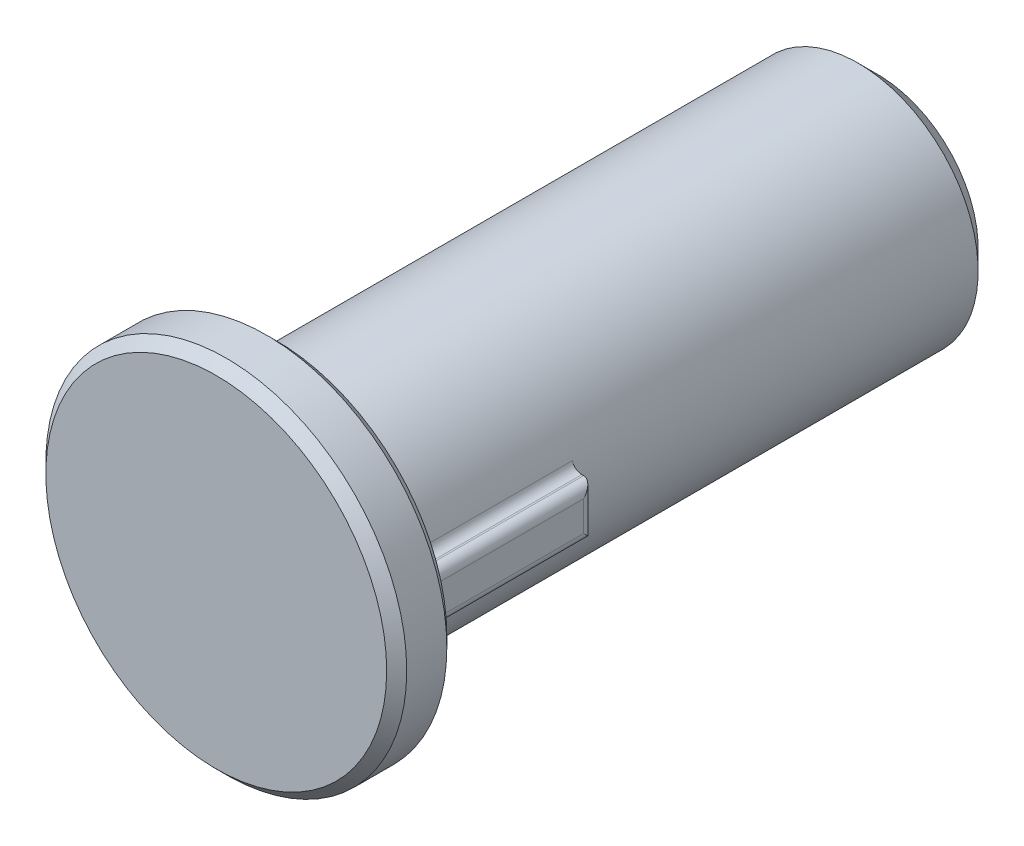
ISO-10303-21;
HEADER;
FILE_DESCRIPTION(('STEP AP214'),'2;1');
FILE_NAME('part.step','',(''),(''),'','','');
FILE_SCHEMA(('AUTOMOTIVE_DESIGN { 1 0 10303 214 1 1 1 1 }'));
ENDSEC;
DATA;
#1=APPLICATION_CONTEXT('core data for automotive mechanical design processes');
#2=APPLICATION_PROTOCOL_DEFINITION('international standard','automotive_design',2000,#1);
#3=PRODUCT_CONTEXT('',#1,'mechanical');
#4=PRODUCT('Part','Part','',(#3));
#5=PRODUCT_RELATED_PRODUCT_CATEGORY('part','',(#4));
#6=PRODUCT_DEFINITION_FORMATION('','',#4);
#7=PRODUCT_DEFINITION_CONTEXT('part definition',#1,'design');
#8=PRODUCT_DEFINITION('design','',#6,#7);
#9=PRODUCT_DEFINITION_SHAPE('','',#8);
#10=(LENGTH_UNIT() NAMED_UNIT(*) SI_UNIT(.MILLI.,.METRE.));
#11=(NAMED_UNIT(*) PLANE_ANGLE_UNIT() SI_UNIT($,.RADIAN.));
#12=(NAMED_UNIT(*) SI_UNIT($,.STERADIAN.) SOLID_ANGLE_UNIT());
#13=UNCERTAINTY_MEASURE_WITH_UNIT(LENGTH_MEASURE(1.E-05),#10,'distance_accuracy_value','');
#14=(GEOMETRIC_REPRESENTATION_CONTEXT(3) GLOBAL_UNCERTAINTY_ASSIGNED_CONTEXT((#13)) GLOBAL_UNIT_ASSIGNED_CONTEXT((#10,
#11,#12)) REPRESENTATION_CONTEXT('',''));
#15=CARTESIAN_POINT('',(0.,0.,0.));
#16=DIRECTION('',(0.,0.,1.));
#17=DIRECTION('',(1.,0.,0.));
#18=AXIS2_PLACEMENT_3D('',#15,#16,#17);
#19=CARTESIAN_POINT('',(0.,0.,0.));
#20=DIRECTION('',(0.,0.,1.));
#21=DIRECTION('',(1.,0.,0.));
#22=AXIS2_PLACEMENT_3D('',#19,#20,#21);
#23=PLANE('',#22);
#24=CARTESIAN_POINT('',(6.32420801106751,-0.66282664863295,0.));
#25=DIRECTION('',(0.,0.,1.));
#26=DIRECTION('',(1.,0.,0.));
#27=AXIS2_PLACEMENT_3D('',#24,#25,#26);
#28=CIRCLE('',#27,1.);
#29=CARTESIAN_POINT('',(6.32420801106751,-1.66282664863295,0.));
#30=VERTEX_POINT('',#29);
#31=CARTESIAN_POINT('',(7.32420801106751,-0.66282664863295,0.));
#32=VERTEX_POINT('',#31);
#33=EDGE_CURVE('E259',#30,#32,#28,.T.);
#34=ORIENTED_EDGE('',*,*,#33,.T.);
#35=DIRECTION('',(0.,1.,0.));
#36=VECTOR('',#35,1.);
#37=CARTESIAN_POINT('',(7.32420801106751,0.83717335136705,0.));
#38=LINE('',#37,#36);
#39=CARTESIAN_POINT('',(7.32420801106751,0.83717335136705,0.));
#40=VERTEX_POINT('',#39);
#41=EDGE_CURVE('E262',#32,#40,#38,.T.);
#42=ORIENTED_EDGE('',*,*,#41,.T.);
#43=CARTESIAN_POINT('',(6.32420801106751,0.83717335136705,0.));
#44=DIRECTION('',(0.,0.,1.));
#45=DIRECTION('',(1.,0.,0.));
#46=AXIS2_PLACEMENT_3D('',#43,#44,#45);
#47=CIRCLE('',#46,1.);
#48=CARTESIAN_POINT('',(6.32420801106751,1.83717335136705,0.));
#49=VERTEX_POINT('',#48);
#50=EDGE_CURVE('E256',#40,#49,#47,.T.);
#51=ORIENTED_EDGE('',*,*,#50,.T.);
#52=DIRECTION('',(-1.,0.,0.));
#53=VECTOR('',#52,1.);
#54=CARTESIAN_POINT('',(6.23496544313012,1.83717335136705,0.));
#55=LINE('',#54,#53);
#56=CARTESIAN_POINT('',(6.23496544313012,1.83717335136705,0.));
#57=VERTEX_POINT('',#56);
#58=EDGE_CURVE('E250',#49,#57,#55,.T.);
#59=ORIENTED_EDGE('',*,*,#58,.T.);
#60=CARTESIAN_POINT('',(0.,0.,0.));
#61=DIRECTION('',(0.,0.,1.));
#62=DIRECTION('',(1.,0.,0.));
#63=AXIS2_PLACEMENT_3D('',#60,#61,#62);
#64=CIRCLE('',#63,6.5);
#65=CARTESIAN_POINT('',(6.28370969544235,-1.66282664863295,0.));
#66=VERTEX_POINT('',#65);
#67=EDGE_CURVE('E247',#57,#66,#64,.T.);
#68=ORIENTED_EDGE('',*,*,#67,.T.);
#69=DIRECTION('',(1.,0.,0.));
#70=VECTOR('',#69,1.);
#71=CARTESIAN_POINT('',(6.32420801106751,-1.66282664863295,0.));
#72=LINE('',#71,#70);
#73=EDGE_CURVE('E253',#66,#30,#72,.T.);
#74=ORIENTED_EDGE('',*,*,#73,.T.);
#75=EDGE_LOOP('',(#34,#42,#51,#59,#68,#74));
#76=FACE_BOUND('',#75,.T.);
#77=CARTESIAN_POINT('',(0.,0.,0.));
#78=DIRECTION('',(0.,0.,1.));
#79=DIRECTION('',(1.,0.,0.));
#80=AXIS2_PLACEMENT_3D('',#77,#78,#79);
#81=CIRCLE('',#80,8.5);
#82=CARTESIAN_POINT('',(8.5,0.,0.));
#83=VERTEX_POINT('',#82);
#84=EDGE_CURVE('E243',#83,#83,#81,.F.);
#85=ORIENTED_EDGE('',*,*,#84,.T.);
#86=EDGE_LOOP('',(#85));
#87=FACE_BOUND('',#86,.T.);
#88=ADVANCED_FACE('F43',(#76,#87),#23,.F.);
#89=CARTESIAN_POINT('',(0.,0.,-30.));
#90=DIRECTION('',(0.,0.,1.));
#91=DIRECTION('',(1.,0.,0.));
#92=AXIS2_PLACEMENT_3D('',#89,#90,#91);
#93=CYLINDRICAL_SURFACE('',#92,6.);
#94=CARTESIAN_POINT('',(0.,0.,-29.));
#95=DIRECTION('',(0.,0.,-1.));
#96=DIRECTION('',(-1.,0.,0.));
#97=AXIS2_PLACEMENT_3D('',#94,#95,#96);
#98=CIRCLE('',#97,6.);
#99=CARTESIAN_POINT('',(-6.,0.,-29.));
#100=VERTEX_POINT('',#99);
#101=EDGE_CURVE('E331',#100,#100,#98,.F.);
#102=ORIENTED_EDGE('',*,*,#101,.T.);
#103=EDGE_LOOP('',(#102));
#104=FACE_BOUND('',#103,.T.);
#105=DIRECTION('',(0.,0.,1.));
#106=VECTOR('',#105,1.);
#107=CARTESIAN_POINT('',(5.80034741117755,-1.53491690643042,-30.));
#108=LINE('',#107,#106);
#109=CARTESIAN_POINT('',(5.80034741117755,-1.53491690643042,-9.));
#110=VERTEX_POINT('',#109);
#111=CARTESIAN_POINT('',(5.80034741117755,-1.53491690643042,-0.500000000000007));
#112=VERTEX_POINT('',#111);
#113=EDGE_CURVE('E200',#110,#112,#108,.T.);
#114=ORIENTED_EDGE('',*,*,#113,.T.);
#115=CARTESIAN_POINT('',(0.,0.,-0.500000000000007));
#116=DIRECTION('',(0.,0.,1.));
#117=DIRECTION('',(1.,0.,0.));
#118=AXIS2_PLACEMENT_3D('',#115,#116,#117);
#119=CIRCLE('',#118,6.);
#120=CARTESIAN_POINT('',(5.7553527167355,1.69585232433882,-0.500000000000007));
#121=VERTEX_POINT('',#120);
#122=EDGE_CURVE('E284',#112,#121,#119,.F.);
#123=ORIENTED_EDGE('',*,*,#122,.T.);
#124=DIRECTION('',(0.,0.,1.));
#125=VECTOR('',#124,1.);
#126=CARTESIAN_POINT('',(5.7553527167355,1.69585232433882,-30.));
#127=LINE('',#126,#125);
#128=CARTESIAN_POINT('',(5.7553527167355,1.69585232433882,-9.));
#129=VERTEX_POINT('',#128);
#130=EDGE_CURVE('E197',#121,#129,#127,.F.);
#131=ORIENTED_EDGE('',*,*,#130,.T.);
#132=CARTESIAN_POINT('',(0.,0.,-9.));
#133=DIRECTION('',(0.,0.,1.));
#134=DIRECTION('',(1.,0.,0.));
#135=AXIS2_PLACEMENT_3D('',#132,#133,#134);
#136=CIRCLE('',#135,6.);
#137=EDGE_CURVE('E186',#110,#129,#136,.T.);
#138=ORIENTED_EDGE('',*,*,#137,.F.);
#139=EDGE_LOOP('',(#114,#123,#131,#138));
#140=FACE_BOUND('',#139,.T.);
#141=ADVANCED_FACE('F456',(#104,#140),#93,.T.);
#142=CARTESIAN_POINT('',(0.,0.,3.));
#143=DIRECTION('',(0.,0.,-1.));
#144=DIRECTION('',(-1.,0.,0.));
#145=AXIS2_PLACEMENT_3D('',#142,#143,#144);
#146=CYLINDRICAL_SURFACE('',#145,9.);
#147=CARTESIAN_POINT('',(0.,0.,0.500000000000002));
#148=DIRECTION('',(0.,0.,1.));
#149=DIRECTION('',(1.,0.,0.));
#150=AXIS2_PLACEMENT_3D('',#147,#148,#149);
#151=CIRCLE('',#150,9.);
#152=CARTESIAN_POINT('',(9.,0.,0.500000000000002));
#153=VERTEX_POINT('',#152);
#154=EDGE_CURVE('E291',#153,#153,#151,.T.);
#155=ORIENTED_EDGE('',*,*,#154,.T.);
#156=EDGE_LOOP('',(#155));
#157=FACE_BOUND('',#156,.T.);
#158=CARTESIAN_POINT('',(0.,0.,2.5));
#159=DIRECTION('',(0.,0.,1.));
#160=DIRECTION('',(1.,0.,0.));
#161=AXIS2_PLACEMENT_3D('',#158,#159,#160);
#162=CIRCLE('',#161,9.);
#163=CARTESIAN_POINT('',(9.,0.,2.5));
#164=VERTEX_POINT('',#163);
#165=EDGE_CURVE('E287',#164,#164,#162,.F.);
#166=ORIENTED_EDGE('',*,*,#165,.T.);
#167=EDGE_LOOP('',(#166));
#168=FACE_BOUND('',#167,.T.);
#169=ADVANCED_FACE('F452',(#157,#168),#146,.T.);
#170=CARTESIAN_POINT('',(0.,0.,3.));
#171=DIRECTION('',(0.,0.,1.));
#172=DIRECTION('',(1.,0.,0.));
#173=AXIS2_PLACEMENT_3D('',#170,#171,#172);
#174=PLANE('',#173);
#175=CARTESIAN_POINT('',(0.,0.,3.));
#176=DIRECTION('',(0.,0.,1.));
#177=DIRECTION('',(1.,0.,0.));
#178=AXIS2_PLACEMENT_3D('',#175,#176,#177);
#179=CIRCLE('',#178,8.5);
#180=CARTESIAN_POINT('',(8.5,0.,3.));
#181=VERTEX_POINT('',#180);
#182=EDGE_CURVE('E295',#181,#181,#179,.T.);
#183=ORIENTED_EDGE('',*,*,#182,.T.);
#184=EDGE_LOOP('',(#183));
#185=FACE_BOUND('',#184,.T.);
#186=ADVANCED_FACE('F455',(#185),#174,.T.);
#187=CARTESIAN_POINT('',(0.,0.,-30.));
#188=DIRECTION('',(0.,0.,-1.));
#189=DIRECTION('',(-1.,0.,0.));
#190=AXIS2_PLACEMENT_3D('',#187,#188,#189);
#191=PLANE('',#190);
#192=DIRECTION('',(0.989422993866325,-0.145059088679747,0.));
#193=VECTOR('',#192,1.);
#194=CARTESIAN_POINT('',(1.84976935108709,-2.7979194677079,-30.));
#195=LINE('',#194,#193);
#196=CARTESIAN_POINT('',(-2.78622919644876,-2.1182367348473,-30.));
#197=VERTEX_POINT('',#196);
#198=CARTESIAN_POINT('',(2.06093375305002,-2.82887823448433,-30.));
#199=VERTEX_POINT('',#198);
#200=EDGE_CURVE('E66',#197,#199,#195,.T.);
#201=ORIENTED_EDGE('',*,*,#200,.T.);
#202=CARTESIAN_POINT('',(0.,0.,-30.));
#203=DIRECTION('',(0.,0.,-1.));
#204=DIRECTION('',(-1.,0.,0.));
#205=AXIS2_PLACEMENT_3D('',#202,#203,#204);
#206=CIRCLE('',#205,3.5);
#207=EDGE_CURVE('E59',#199,#197,#206,.F.);
#208=ORIENTED_EDGE('',*,*,#207,.T.);
#209=EDGE_LOOP('',(#201,#208));
#210=FACE_BOUND('',#209,.T.);
#211=CARTESIAN_POINT('',(0.,0.,-30.));
#212=DIRECTION('',(0.,0.,-1.));
#213=DIRECTION('',(-1.,0.,0.));
#214=AXIS2_PLACEMENT_3D('',#211,#212,#213);
#215=CIRCLE('',#214,5.);
#216=CARTESIAN_POINT('',(-5.,0.,-30.));
#217=VERTEX_POINT('',#216);
#218=EDGE_CURVE('E299',#217,#217,#215,.T.);
#219=ORIENTED_EDGE('',*,*,#218,.T.);
#220=EDGE_LOOP('',(#219));
#221=FACE_BOUND('',#220,.T.);
#222=ADVANCED_FACE('F463',(#210,#221),#191,.T.);
#223=CARTESIAN_POINT('',(5.17452538988969,-1.16282664863295,-9.));
#224=DIRECTION('',(0.,1.,0.));
#225=DIRECTION('',(-1.,0.,0.));
#226=AXIS2_PLACEMENT_3D('',#223,#224,#225);
#227=PLANE('',#226);
#228=DIRECTION('',(0.,0.,1.));
#229=VECTOR('',#228,1.);
#230=CARTESIAN_POINT('',(6.32420801106751,-1.16282664863295,-9.));
#231=LINE('',#230,#229);
#232=CARTESIAN_POINT('',(6.32420801106751,-1.16282664863295,-9.));
#233=VERTEX_POINT('',#232);
#234=CARTESIAN_POINT('',(6.32420801106751,-1.16282664863295,-0.500000000000006));
#235=VERTEX_POINT('',#234);
#236=EDGE_CURVE('E190',#233,#235,#231,.T.);
#237=ORIENTED_EDGE('',*,*,#236,.T.);
#238=DIRECTION('',(-1.,0.,0.));
#239=VECTOR('',#238,1.);
#240=CARTESIAN_POINT('',(6.28370969544234,-1.16282664863295,-0.500000000000006));
#241=LINE('',#240,#239);
#242=CARTESIAN_POINT('',(6.28370969544234,-1.16282664863295,-0.500000000000007));
#243=VERTEX_POINT('',#242);
#244=EDGE_CURVE('E272',#235,#243,#241,.T.);
#245=ORIENTED_EDGE('',*,*,#244,.T.);
#246=DIRECTION('',(0.,0.,-1.));
#247=VECTOR('',#246,1.);
#248=CARTESIAN_POINT('',(6.28370969544234,-1.16282664863295,-9.));
#249=LINE('',#248,#247);
#250=CARTESIAN_POINT('',(6.28370969544234,-1.16282664863295,-9.));
#251=VERTEX_POINT('',#250);
#252=EDGE_CURVE('E194',#243,#251,#249,.T.);
#253=ORIENTED_EDGE('',*,*,#252,.T.);
#254=DIRECTION('',(-1.,0.,0.));
#255=VECTOR('',#254,1.);
#256=CARTESIAN_POINT('',(5.17452538988969,-1.16282664863295,-9.));
#257=LINE('',#256,#255);
#258=EDGE_CURVE('E177',#233,#251,#257,.T.);
#259=ORIENTED_EDGE('',*,*,#258,.F.);
#260=EDGE_LOOP('',(#237,#245,#253,#259));
#261=FACE_BOUND('',#260,.T.);
#262=ADVANCED_FACE('F470',(#261),#227,.F.);
#263=CARTESIAN_POINT('',(5.17452538988969,1.33717335136705,-9.));
#264=DIRECTION('',(0.,-1.,0.));
#265=DIRECTION('',(1.,0.,0.));
#266=AXIS2_PLACEMENT_3D('',#263,#264,#265);
#267=PLANE('',#266);
#268=DIRECTION('',(0.,0.,-1.));
#269=VECTOR('',#268,1.);
#270=CARTESIAN_POINT('',(6.23496544313012,1.33717335136705,0.));
#271=LINE('',#270,#269);
#272=CARTESIAN_POINT('',(6.23496544313012,1.33717335136705,-9.));
#273=VERTEX_POINT('',#272);
#274=CARTESIAN_POINT('',(6.23496544313012,1.33717335136705,-0.500000000000007));
#275=VERTEX_POINT('',#274);
#276=EDGE_CURVE('E207',#273,#275,#271,.F.);
#277=ORIENTED_EDGE('',*,*,#276,.T.);
#278=DIRECTION('',(1.,0.,0.));
#279=VECTOR('',#278,1.);
#280=CARTESIAN_POINT('',(6.32420801106751,1.33717335136705,-0.500000000000006));
#281=LINE('',#280,#279);
#282=CARTESIAN_POINT('',(6.32420801106751,1.33717335136705,-0.500000000000006));
#283=VERTEX_POINT('',#282);
#284=EDGE_CURVE('E275',#275,#283,#281,.T.);
#285=ORIENTED_EDGE('',*,*,#284,.T.);
#286=DIRECTION('',(0.,0.,1.));
#287=VECTOR('',#286,1.);
#288=CARTESIAN_POINT('',(6.32420801106751,1.33717335136705,-9.));
#289=LINE('',#288,#287);
#290=CARTESIAN_POINT('',(6.32420801106751,1.33717335136705,-9.));
#291=VERTEX_POINT('',#290);
#292=EDGE_CURVE('E204',#283,#291,#289,.F.);
#293=ORIENTED_EDGE('',*,*,#292,.T.);
#294=DIRECTION('',(1.,0.,0.));
#295=VECTOR('',#294,1.);
#296=CARTESIAN_POINT('',(5.17452538988969,1.33717335136705,-9.));
#297=LINE('',#296,#295);
#298=EDGE_CURVE('E181',#273,#291,#297,.T.);
#299=ORIENTED_EDGE('',*,*,#298,.F.);
#300=EDGE_LOOP('',(#277,#285,#293,#299));
#301=FACE_BOUND('',#300,.T.);
#302=ADVANCED_FACE('F474',(#301),#267,.F.);
#303=CARTESIAN_POINT('',(6.82420801106751,1.33717335136705,-9.));
#304=DIRECTION('',(-1.,0.,0.));
#305=DIRECTION('',(0.,0.,1.));
#306=AXIS2_PLACEMENT_3D('',#303,#304,#305);
#307=PLANE('',#306);
#308=DIRECTION('',(0.,0.,1.));
#309=VECTOR('',#308,1.);
#310=CARTESIAN_POINT('',(6.82420801106751,0.83717335136705,-9.));
#311=LINE('',#310,#309);
#312=CARTESIAN_POINT('',(6.82420801106751,0.83717335136705,-8.5));
#313=VERTEX_POINT('',#312);
#314=CARTESIAN_POINT('',(6.82420801106751,0.83717335136705,-0.500000000000006));
#315=VERTEX_POINT('',#314);
#316=EDGE_CURVE('E215',#313,#315,#311,.T.);
#317=ORIENTED_EDGE('',*,*,#316,.T.);
#318=DIRECTION('',(0.,-1.,0.));
#319=VECTOR('',#318,1.);
#320=CARTESIAN_POINT('',(6.82420801106751,-0.66282664863295,-0.500000000000006));
#321=LINE('',#320,#319);
#322=CARTESIAN_POINT('',(6.82420801106751,-0.66282664863295,-0.500000000000006));
#323=VERTEX_POINT('',#322);
#324=EDGE_CURVE('E232',#315,#323,#321,.T.);
#325=ORIENTED_EDGE('',*,*,#324,.T.);
#326=DIRECTION('',(0.,0.,1.));
#327=VECTOR('',#326,1.);
#328=CARTESIAN_POINT('',(6.82420801106751,-0.66282664863295,-9.));
#329=LINE('',#328,#327);
#330=CARTESIAN_POINT('',(6.82420801106751,-0.66282664863295,-8.5));
#331=VERTEX_POINT('',#330);
#332=EDGE_CURVE('E222',#323,#331,#329,.F.);
#333=ORIENTED_EDGE('',*,*,#332,.T.);
#334=DIRECTION('',(0.,-1.,0.));
#335=VECTOR('',#334,1.);
#336=CARTESIAN_POINT('',(6.82420801106751,1.33717335136705,-8.5));
#337=LINE('',#336,#335);
#338=EDGE_CURVE('E219',#331,#313,#337,.F.);
#339=ORIENTED_EDGE('',*,*,#338,.T.);
#340=EDGE_LOOP('',(#317,#325,#333,#339));
#341=FACE_BOUND('',#340,.T.);
#342=ADVANCED_FACE('F471',(#341),#307,.F.);
#343=CARTESIAN_POINT('',(0.,0.,-9.));
#344=DIRECTION('',(0.,0.,1.));
#345=DIRECTION('',(1.,0.,0.));
#346=AXIS2_PLACEMENT_3D('',#343,#344,#345);
#347=PLANE('',#346);
#348=ORIENTED_EDGE('',*,*,#298,.T.);
#349=DIRECTION('',(0.,-1.,0.));
#350=VECTOR('',#349,1.);
#351=CARTESIAN_POINT('',(6.32420801106751,0.,-9.));
#352=LINE('',#351,#350);
#353=EDGE_CURVE('E211',#291,#233,#352,.T.);
#354=ORIENTED_EDGE('',*,*,#353,.T.);
#355=ORIENTED_EDGE('',*,*,#258,.T.);
#356=CARTESIAN_POINT('',(6.28370969544234,-1.66282664863295,-9.));
#357=DIRECTION('',(0.,0.,1.));
#358=DIRECTION('',(1.,0.,0.));
#359=AXIS2_PLACEMENT_3D('',#356,#357,#358);
#360=CIRCLE('',#359,0.5);
#361=EDGE_CURVE('E225',#251,#110,#360,.T.);
#362=ORIENTED_EDGE('',*,*,#361,.T.);
#363=ORIENTED_EDGE('',*,*,#137,.T.);
#364=CARTESIAN_POINT('',(6.23496544313012,1.83717335136705,-9.));
#365=DIRECTION('',(0.,0.,1.));
#366=DIRECTION('',(1.,0.,0.));
#367=AXIS2_PLACEMENT_3D('',#364,#365,#366);
#368=CIRCLE('',#367,0.5);
#369=EDGE_CURVE('E229',#129,#273,#368,.T.);
#370=ORIENTED_EDGE('',*,*,#369,.T.);
#371=EDGE_LOOP('',(#348,#354,#355,#362,#363,#370));
#372=FACE_BOUND('',#371,.T.);
#373=ADVANCED_FACE('F450',(#372),#347,.F.);
#374=CARTESIAN_POINT('',(6.28370969544234,-1.66282664863295,-30.));
#375=DIRECTION('',(0.,0.,1.));
#376=DIRECTION('',(1.,0.,0.));
#377=AXIS2_PLACEMENT_3D('',#374,#375,#376);
#378=CYLINDRICAL_SURFACE('',#377,0.5);
#379=ORIENTED_EDGE('',*,*,#252,.F.);
#380=CARTESIAN_POINT('',(6.28370969544234,-1.66282664863295,-0.500000000000007));
#381=DIRECTION('',(0.,0.,1.));
#382=DIRECTION('',(1.,0.,0.));
#383=AXIS2_PLACEMENT_3D('',#380,#381,#382);
#384=CIRCLE('',#383,0.5);
#385=EDGE_CURVE('E278',#243,#112,#384,.T.);
#386=ORIENTED_EDGE('',*,*,#385,.T.);
#387=ORIENTED_EDGE('',*,*,#113,.F.);
#388=ORIENTED_EDGE('',*,*,#361,.F.);
#389=EDGE_LOOP('',(#379,#386,#387,#388));
#390=FACE_BOUND('',#389,.T.);
#391=ADVANCED_FACE('F446',(#390),#378,.F.);
#392=CARTESIAN_POINT('',(6.23496544313012,1.83717335136705,-30.));
#393=DIRECTION('',(0.,0.,1.));
#394=DIRECTION('',(1.,0.,0.));
#395=AXIS2_PLACEMENT_3D('',#392,#393,#394);
#396=CYLINDRICAL_SURFACE('',#395,0.5);
#397=ORIENTED_EDGE('',*,*,#130,.F.);
#398=CARTESIAN_POINT('',(6.23496544313012,1.83717335136705,-0.500000000000007));
#399=DIRECTION('',(0.,0.,1.));
#400=DIRECTION('',(1.,0.,0.));
#401=AXIS2_PLACEMENT_3D('',#398,#399,#400);
#402=CIRCLE('',#401,0.5);
#403=EDGE_CURVE('E281',#121,#275,#402,.T.);
#404=ORIENTED_EDGE('',*,*,#403,.T.);
#405=ORIENTED_EDGE('',*,*,#276,.F.);
#406=ORIENTED_EDGE('',*,*,#369,.F.);
#407=EDGE_LOOP('',(#397,#404,#405,#406));
#408=FACE_BOUND('',#407,.T.);
#409=ADVANCED_FACE('F436',(#408),#396,.F.);
#410=CARTESIAN_POINT('',(6.32420801106751,0.83717335136705,-9.));
#411=DIRECTION('',(0.,0.,1.));
#412=DIRECTION('',(1.,0.,0.));
#413=AXIS2_PLACEMENT_3D('',#410,#411,#412);
#414=CYLINDRICAL_SURFACE('',#413,0.5);
#415=ORIENTED_EDGE('',*,*,#292,.F.);
#416=CARTESIAN_POINT('',(6.32420801106751,0.83717335136705,-0.500000000000006));
#417=DIRECTION('',(0.,0.,1.));
#418=DIRECTION('',(1.,0.,0.));
#419=AXIS2_PLACEMENT_3D('',#416,#417,#418);
#420=CIRCLE('',#419,0.5);
#421=EDGE_CURVE('E269',#283,#315,#420,.F.);
#422=ORIENTED_EDGE('',*,*,#421,.T.);
#423=ORIENTED_EDGE('',*,*,#316,.F.);
#424=CARTESIAN_POINT('',(6.32420801106751,0.83717335136705,-8.5));
#425=DIRECTION('',(0.,0.707106781186547,0.707106781186547));
#426=DIRECTION('',(0.,-0.707106781186547,0.707106781186547));
#427=AXIS2_PLACEMENT_3D('',#424,#425,#426);
#428=ELLIPSE('',#427,0.707106781186547,0.5);
#429=EDGE_CURVE('E182',#291,#313,#428,.F.);
#430=ORIENTED_EDGE('',*,*,#429,.F.);
#431=EDGE_LOOP('',(#415,#422,#423,#430));
#432=FACE_BOUND('',#431,.T.);
#433=ADVANCED_FACE('F432',(#432),#414,.T.);
#434=CARTESIAN_POINT('',(6.32420801106751,-0.66282664863295,-9.));
#435=DIRECTION('',(0.,0.,1.));
#436=DIRECTION('',(1.,0.,0.));
#437=AXIS2_PLACEMENT_3D('',#434,#435,#436);
#438=CYLINDRICAL_SURFACE('',#437,0.5);
#439=ORIENTED_EDGE('',*,*,#332,.F.);
#440=CARTESIAN_POINT('',(6.32420801106751,-0.66282664863295,-0.500000000000006));
#441=DIRECTION('',(0.,0.,1.));
#442=DIRECTION('',(1.,0.,0.));
#443=AXIS2_PLACEMENT_3D('',#440,#441,#442);
#444=CIRCLE('',#443,0.5);
#445=EDGE_CURVE('E266',#323,#235,#444,.F.);
#446=ORIENTED_EDGE('',*,*,#445,.T.);
#447=ORIENTED_EDGE('',*,*,#236,.F.);
#448=CARTESIAN_POINT('',(6.32420801106751,-0.66282664863295,-8.5));
#449=DIRECTION('',(0.,-0.707106781186547,0.707106781186547));
#450=DIRECTION('',(0.,0.707106781186547,0.707106781186547));
#451=AXIS2_PLACEMENT_3D('',#448,#449,#450);
#452=ELLIPSE('',#451,0.707106781186547,0.5);
#453=EDGE_CURVE('E233',#331,#233,#452,.F.);
#454=ORIENTED_EDGE('',*,*,#453,.F.);
#455=EDGE_LOOP('',(#439,#446,#447,#454));
#456=FACE_BOUND('',#455,.T.);
#457=ADVANCED_FACE('F435',(#456),#438,.T.);
#458=CARTESIAN_POINT('',(6.32420801106751,0.,-8.5));
#459=DIRECTION('',(0.,-1.,0.));
#460=DIRECTION('',(0.,0.,-1.));
#461=AXIS2_PLACEMENT_3D('',#458,#459,#460);
#462=CYLINDRICAL_SURFACE('',#461,0.5);
#463=ORIENTED_EDGE('',*,*,#429,.T.);
#464=ORIENTED_EDGE('',*,*,#338,.F.);
#465=ORIENTED_EDGE('',*,*,#453,.T.);
#466=ORIENTED_EDGE('',*,*,#353,.F.);
#467=EDGE_LOOP('',(#463,#464,#465,#466));
#468=FACE_BOUND('',#467,.T.);
#469=ADVANCED_FACE('F385',(#468),#462,.T.);
#470=CARTESIAN_POINT('',(0.,0.,-0.500000000000007));
#471=DIRECTION('',(0.,0.,1.));
#472=DIRECTION('',(1.,0.,0.));
#473=AXIS2_PLACEMENT_3D('',#470,#471,#472);
#474=CONICAL_SURFACE('',#473,6.,0.785398163397443);
#475=DIRECTION('',(0.678274822354012,0.199858113071823,0.707106781186551));
#476=VECTOR('',#475,1.);
#477=CARTESIAN_POINT('',(5.7553527167355,1.69585232433882,-0.500000000000007));
#478=LINE('',#477,#476);
#479=EDGE_CURVE('E236',#121,#57,#478,.T.);
#480=ORIENTED_EDGE('',*,*,#479,.F.);
#481=ORIENTED_EDGE('',*,*,#122,.F.);
#482=DIRECTION('',(-0.68357749794691,0.18089169218247,-0.707106781186551));
#483=VECTOR('',#482,1.);
#484=CARTESIAN_POINT('',(6.28370969544235,-1.66282664863295,0.));
#485=LINE('',#484,#483);
#486=EDGE_CURVE('E321',#66,#112,#485,.T.);
#487=ORIENTED_EDGE('',*,*,#486,.F.);
#488=ORIENTED_EDGE('',*,*,#67,.F.);
#489=EDGE_LOOP('',(#480,#481,#487,#488));
#490=FACE_BOUND('',#489,.T.);
#491=ADVANCED_FACE('F378',(#490),#474,.T.);
#492=CARTESIAN_POINT('',(6.23496544313012,1.83717335136705,-0.500000000000007));
#493=DIRECTION('',(0.,0.,-1.));
#494=DIRECTION('',(-1.,0.,0.));
#495=AXIS2_PLACEMENT_3D('',#492,#493,#494);
#496=CONICAL_SURFACE('',#495,0.500000000000002,0.785398163397443);
#497=ORIENTED_EDGE('',*,*,#403,.F.);
#498=ORIENTED_EDGE('',*,*,#479,.T.);
#499=DIRECTION('',(0.,0.707106781186544,0.707106781186551));
#500=VECTOR('',#499,1.);
#501=CARTESIAN_POINT('',(6.23496544313012,1.33717335136705,-0.500000000000007));
#502=LINE('',#501,#500);
#503=EDGE_CURVE('E317',#275,#57,#502,.T.);
#504=ORIENTED_EDGE('',*,*,#503,.F.);
#505=EDGE_LOOP('',(#497,#498,#504));
#506=FACE_BOUND('',#505,.T.);
#507=ADVANCED_FACE('F384',(#506),#496,.F.);
#508=CARTESIAN_POINT('',(6.28370969544234,-1.66282664863295,-0.500000000000007));
#509=DIRECTION('',(0.,0.,-1.));
#510=DIRECTION('',(-1.,0.,0.));
#511=AXIS2_PLACEMENT_3D('',#508,#509,#510);
#512=CONICAL_SURFACE('',#511,0.500000000000002,0.785398163397443);
#513=ORIENTED_EDGE('',*,*,#486,.T.);
#514=ORIENTED_EDGE('',*,*,#385,.F.);
#515=DIRECTION('',(0.,0.707106781186544,-0.707106781186551));
#516=VECTOR('',#515,1.);
#517=CARTESIAN_POINT('',(6.28370969544234,-1.66282664863295,0.));
#518=LINE('',#517,#516);
#519=EDGE_CURVE('E313',#66,#243,#518,.T.);
#520=ORIENTED_EDGE('',*,*,#519,.F.);
#521=EDGE_LOOP('',(#513,#514,#520));
#522=FACE_BOUND('',#521,.T.);
#523=ADVANCED_FACE('F392',(#522),#512,.F.);
#524=CARTESIAN_POINT('',(5.17452538988969,1.33717335136705,-0.500000000000006));
#525=DIRECTION('',(0.,0.70710678118655,-0.707106781186545));
#526=DIRECTION('',(-1.,0.,0.));
#527=AXIS2_PLACEMENT_3D('',#524,#525,#526);
#528=PLANE('',#527);
#529=ORIENTED_EDGE('',*,*,#503,.T.);
#530=ORIENTED_EDGE('',*,*,#58,.F.);
#531=DIRECTION('',(0.,0.707106781186545,0.70710678118655));
#532=VECTOR('',#531,1.);
#533=CARTESIAN_POINT('',(6.32420801106751,1.33717335136705,-0.500000000000006));
#534=LINE('',#533,#532);
#535=EDGE_CURVE('E309',#283,#49,#534,.T.);
#536=ORIENTED_EDGE('',*,*,#535,.F.);
#537=ORIENTED_EDGE('',*,*,#284,.F.);
#538=EDGE_LOOP('',(#529,#530,#536,#537));
#539=FACE_BOUND('',#538,.T.);
#540=ADVANCED_FACE('F399',(#539),#528,.T.);
#541=CARTESIAN_POINT('',(5.17452538988969,-1.16282664863295,-0.500000000000006));
#542=DIRECTION('',(0.,-0.70710678118655,-0.707106781186545));
#543=DIRECTION('',(1.,0.,0.));
#544=AXIS2_PLACEMENT_3D('',#541,#542,#543);
#545=PLANE('',#544);
#546=ORIENTED_EDGE('',*,*,#519,.T.);
#547=ORIENTED_EDGE('',*,*,#244,.F.);
#548=DIRECTION('',(0.,0.707106781186545,-0.70710678118655));
#549=VECTOR('',#548,1.);
#550=CARTESIAN_POINT('',(6.32420801106751,-1.66282664863295,0.));
#551=LINE('',#550,#549);
#552=EDGE_CURVE('E305',#30,#235,#551,.T.);
#553=ORIENTED_EDGE('',*,*,#552,.F.);
#554=ORIENTED_EDGE('',*,*,#73,.F.);
#555=EDGE_LOOP('',(#546,#547,#553,#554));
#556=FACE_BOUND('',#555,.T.);
#557=ADVANCED_FACE('F406',(#556),#545,.T.);
#558=CARTESIAN_POINT('',(6.32420801106751,0.83717335136705,0.));
#559=DIRECTION('',(0.,0.,1.));
#560=DIRECTION('',(1.,0.,0.));
#561=AXIS2_PLACEMENT_3D('',#558,#559,#560);
#562=CONICAL_SURFACE('',#561,1.,0.785398163397445);
#563=ORIENTED_EDGE('',*,*,#535,.T.);
#564=ORIENTED_EDGE('',*,*,#50,.F.);
#565=DIRECTION('',(0.707106781186545,0.,0.70710678118655));
#566=VECTOR('',#565,1.);
#567=CARTESIAN_POINT('',(6.82420801106751,0.83717335136705,-0.500000000000006));
#568=LINE('',#567,#566);
#569=EDGE_CURVE('E302',#315,#40,#568,.T.);
#570=ORIENTED_EDGE('',*,*,#569,.F.);
#571=ORIENTED_EDGE('',*,*,#421,.F.);
#572=EDGE_LOOP('',(#563,#564,#570,#571));
#573=FACE_BOUND('',#572,.T.);
#574=ADVANCED_FACE('F413',(#573),#562,.T.);
#575=CARTESIAN_POINT('',(6.32420801106751,-0.66282664863295,0.));
#576=DIRECTION('',(0.,0.,1.));
#577=DIRECTION('',(1.,0.,0.));
#578=AXIS2_PLACEMENT_3D('',#575,#576,#577);
#579=CONICAL_SURFACE('',#578,1.,0.785398163397445);
#580=ORIENTED_EDGE('',*,*,#552,.T.);
#581=ORIENTED_EDGE('',*,*,#445,.F.);
#582=DIRECTION('',(-0.707106781186545,0.,-0.70710678118655));
#583=VECTOR('',#582,1.);
#584=CARTESIAN_POINT('',(7.32420801106751,-0.66282664863295,0.));
#585=LINE('',#584,#583);
#586=EDGE_CURVE('E175',#32,#323,#585,.T.);
#587=ORIENTED_EDGE('',*,*,#586,.F.);
#588=ORIENTED_EDGE('',*,*,#33,.F.);
#589=EDGE_LOOP('',(#580,#581,#587,#588));
#590=FACE_BOUND('',#589,.T.);
#591=ADVANCED_FACE('F420',(#590),#579,.T.);
#592=CARTESIAN_POINT('',(6.82420801106751,1.33717335136705,-0.500000000000006));
#593=DIRECTION('',(0.70710678118655,0.,-0.707106781186545));
#594=DIRECTION('',(0.,1.,0.));
#595=AXIS2_PLACEMENT_3D('',#592,#593,#594);
#596=PLANE('',#595);
#597=ORIENTED_EDGE('',*,*,#569,.T.);
#598=ORIENTED_EDGE('',*,*,#41,.F.);
#599=ORIENTED_EDGE('',*,*,#586,.T.);
#600=ORIENTED_EDGE('',*,*,#324,.F.);
#601=EDGE_LOOP('',(#597,#598,#599,#600));
#602=FACE_BOUND('',#601,.T.);
#603=ADVANCED_FACE('F375',(#602),#596,.T.);
#604=CARTESIAN_POINT('',(0.,0.,0.500000000000002));
#605=DIRECTION('',(0.,0.,1.));
#606=DIRECTION('',(1.,0.,0.));
#607=AXIS2_PLACEMENT_3D('',#604,#605,#606);
#608=CONICAL_SURFACE('',#607,9.,0.785398163397448);
#609=ORIENTED_EDGE('',*,*,#84,.F.);
#610=EDGE_LOOP('',(#609));
#611=FACE_BOUND('',#610,.T.);
#612=ORIENTED_EDGE('',*,*,#154,.F.);
#613=EDGE_LOOP('',(#612));
#614=FACE_BOUND('',#613,.T.);
#615=ADVANCED_FACE('F368',(#611,#614),#608,.T.);
#616=CARTESIAN_POINT('',(0.,0.,3.));
#617=DIRECTION('',(0.,0.,-1.));
#618=DIRECTION('',(-1.,0.,0.));
#619=AXIS2_PLACEMENT_3D('',#616,#617,#618);
#620=CONICAL_SURFACE('',#619,8.5,0.785398163397448);
#621=ORIENTED_EDGE('',*,*,#165,.F.);
#622=EDGE_LOOP('',(#621));
#623=FACE_BOUND('',#622,.T.);
#624=ORIENTED_EDGE('',*,*,#182,.F.);
#625=EDGE_LOOP('',(#624));
#626=FACE_BOUND('',#625,.T.);
#627=ADVANCED_FACE('F361',(#623,#626),#620,.T.);
#628=CARTESIAN_POINT('',(0.,0.,-30.));
#629=DIRECTION('',(0.,0.,1.));
#630=DIRECTION('',(1.,0.,0.));
#631=AXIS2_PLACEMENT_3D('',#628,#629,#630);
#632=CONICAL_SURFACE('',#631,5.,0.785398163397443);
#633=ORIENTED_EDGE('',*,*,#101,.F.);
#634=EDGE_LOOP('',(#633));
#635=FACE_BOUND('',#634,.T.);
#636=ORIENTED_EDGE('',*,*,#218,.F.);
#637=EDGE_LOOP('',(#636));
#638=FACE_BOUND('',#637,.T.);
#639=ADVANCED_FACE('F354',(#635,#638),#632,.T.);
#640=CARTESIAN_POINT('',(0.,0.,-20.));
#641=DIRECTION('',(0.,0.,-1.));
#642=DIRECTION('',(-1.,0.,0.));
#643=AXIS2_PLACEMENT_3D('',#640,#641,#642);
#644=CYLINDRICAL_SURFACE('',#643,3.);
#645=DIRECTION('',(0.,0.,-1.));
#646=VECTOR('',#645,1.);
#647=CARTESIAN_POINT('',(-2.50253525014595,-1.65448400469056,-20.));
#648=LINE('',#647,#646);
#649=CARTESIAN_POINT('',(-2.50253525014595,-1.65448400469056,-20.));
#650=VERTEX_POINT('',#649);
#651=CARTESIAN_POINT('',(-2.50253525014595,-1.65448400469056,-29.5));
#652=VERTEX_POINT('',#651);
#653=EDGE_CURVE('E163',#650,#652,#648,.T.);
#654=ORIENTED_EDGE('',*,*,#653,.T.);
#655=CARTESIAN_POINT('',(0.,0.,-29.5));
#656=DIRECTION('',(0.,0.,-1.));
#657=DIRECTION('',(-1.,0.,0.));
#658=AXIS2_PLACEMENT_3D('',#655,#656,#657);
#659=CIRCLE('',#658,3.);
#660=CARTESIAN_POINT('',(1.92229889542697,-2.30320797077474,-29.5));
#661=VERTEX_POINT('',#660);
#662=EDGE_CURVE('E159',#652,#661,#659,.T.);
#663=ORIENTED_EDGE('',*,*,#662,.T.);
#664=DIRECTION('',(0.,0.,-1.));
#665=VECTOR('',#664,1.);
#666=CARTESIAN_POINT('',(1.92229889542697,-2.30320797077474,-20.));
#667=LINE('',#666,#665);
#668=CARTESIAN_POINT('',(1.92229889542697,-2.30320797077474,-20.));
#669=VERTEX_POINT('',#668);
#670=EDGE_CURVE('E153',#669,#661,#667,.T.);
#671=ORIENTED_EDGE('',*,*,#670,.F.);
#672=CARTESIAN_POINT('',(0.,0.,-20.));
#673=DIRECTION('',(0.,0.,-1.));
#674=DIRECTION('',(-1.,0.,0.));
#675=AXIS2_PLACEMENT_3D('',#672,#673,#674);
#676=CIRCLE('',#675,3.);
#677=EDGE_CURVE('E157',#650,#669,#676,.T.);
#678=ORIENTED_EDGE('',*,*,#677,.F.);
#679=EDGE_LOOP('',(#654,#663,#671,#678));
#680=FACE_BOUND('',#679,.T.);
#681=ADVANCED_FACE('F156',(#680),#644,.F.);
#682=CARTESIAN_POINT('',(1.92229889542697,-2.30320797077474,-20.));
#683=DIRECTION('',(-0.145059088679747,-0.989422993866325,0.));
#684=DIRECTION('',(0.989422993866325,-0.145059088679747,0.));
#685=AXIS2_PLACEMENT_3D('',#682,#683,#684);
#686=PLANE('',#685);
#687=ORIENTED_EDGE('',*,*,#670,.T.);
#688=DIRECTION('',(-0.989422993866325,0.145059088679747,0.));
#689=VECTOR('',#688,1.);
#690=CARTESIAN_POINT('',(-2.50253525014595,-1.65448400469056,-29.5));
#691=LINE('',#690,#689);
#692=EDGE_CURVE('E11',#661,#652,#691,.T.);
#693=ORIENTED_EDGE('',*,*,#692,.T.);
#694=ORIENTED_EDGE('',*,*,#653,.F.);
#695=DIRECTION('',(-0.989422993866325,0.145059088679747,0.));
#696=VECTOR('',#695,1.);
#697=CARTESIAN_POINT('',(1.92229889542697,-2.30320797077474,-20.));
#698=LINE('',#697,#696);
#699=EDGE_CURVE('E164',#669,#650,#698,.T.);
#700=ORIENTED_EDGE('',*,*,#699,.F.);
#701=EDGE_LOOP('',(#687,#693,#694,#700));
#702=FACE_BOUND('',#701,.T.);
#703=ADVANCED_FACE('F170',(#702),#686,.F.);
#704=CARTESIAN_POINT('',(0.,0.,-20.));
#705=DIRECTION('',(0.,0.,-1.));
#706=DIRECTION('',(-1.,0.,0.));
#707=AXIS2_PLACEMENT_3D('',#704,#705,#706);
#708=PLANE('',#707);
#709=ORIENTED_EDGE('',*,*,#677,.T.);
#710=ORIENTED_EDGE('',*,*,#699,.T.);
#711=EDGE_LOOP('',(#709,#710));
#712=FACE_BOUND('',#711,.T.);
#713=ADVANCED_FACE('F167',(#712),#708,.T.);
#714=CARTESIAN_POINT('',(1.92229889542697,-2.30320797077474,-29.5));
#715=DIRECTION('',(0.10257226527819,0.699627708424772,-0.70710678118655));
#716=DIRECTION('',(0.989422993866325,-0.145059088679747,0.));
#717=AXIS2_PLACEMENT_3D('',#714,#715,#716);
#718=PLANE('',#717);
#719=CARTESIAN_POINT('',(1.92229889542697,-2.30320797077474,-29.5));
#720=CARTESIAN_POINT('',(1.93464111457324,-2.34696124520138,-29.541500144713));
#721=CARTESIAN_POINT('',(1.94677017237459,-2.39073014703776,-29.583046672535));
#722=CARTESIAN_POINT('',(1.9706253454511,-2.47829416745208,-29.6662241181015));
#723=CARTESIAN_POINT('',(1.9823514766972,-2.52208928492071,-29.7078550324318));
#724=CARTESIAN_POINT('',(2.01696217794742,-2.65351232650864,-29.8328674149208));
#725=CARTESIAN_POINT('',(2.03927885576316,-2.74117722901569,-29.91636784827));
#726=CARTESIAN_POINT('',(2.06093375305002,-2.82887823448433,-30.));
#727=B_SPLINE_CURVE_WITH_KNOTS('',3,(#719,#720,#721,#722,#723,#724,#725,#726),.UNSPECIFIED.,.F.,
.F.,(4,2,2,4),(0.,0.18466212247391,0.369316916969856,0.738629505439542),.UNSPECIFIED.);
#728=EDGE_CURVE('E340',#199,#661,#727,.F.);
#729=ORIENTED_EDGE('',*,*,#728,.F.);
#730=ORIENTED_EDGE('',*,*,#200,.F.);
#731=CARTESIAN_POINT('',(-2.78622919644876,-2.1182367348473,-30.));
#732=CARTESIAN_POINT('',(-2.74031109173334,-2.04044259241961,-29.91636784827));
#733=CARTESIAN_POINT('',(-2.6937694203856,-1.96287299741963,-29.8328674149208));
#734=CARTESIAN_POINT('',(-2.62289035458029,-1.84691578750226,-29.7078550324318));
#735=CARTESIAN_POINT('',(-2.5990863383469,-1.80832973718284,-29.6662241181015));
#736=CARTESIAN_POINT('',(-2.55109987636521,-1.73129840316798,-29.583046672535));
#737=CARTESIAN_POINT('',(-2.52691741563652,-1.6928531251196,-29.541500144713));
#738=CARTESIAN_POINT('',(-2.50253525014596,-1.65448400469056,-29.5));
#739=B_SPLINE_CURVE_WITH_KNOTS('',3,(#731,#732,#733,#734,#735,#736,#737,#738),.UNSPECIFIED.,.F.,
.F.,(4,2,2,4),(0.,0.369312588469686,0.553967382965638,0.738629505439542),.UNSPECIFIED.);
#740=EDGE_CURVE('E49',#652,#197,#739,.F.);
#741=ORIENTED_EDGE('',*,*,#740,.F.);
#742=ORIENTED_EDGE('',*,*,#692,.F.);
#743=EDGE_LOOP('',(#729,#730,#741,#742));
#744=FACE_BOUND('',#743,.T.);
#745=ADVANCED_FACE('F46',(#744),#718,.T.);
#746=CARTESIAN_POINT('',(0.,0.,-29.5));
#747=DIRECTION('',(0.,0.,-1.));
#748=DIRECTION('',(-1.,0.,0.));
#749=AXIS2_PLACEMENT_3D('',#746,#747,#748);
#750=CONICAL_SURFACE('',#749,3.,0.785398163397452);
#751=ORIENTED_EDGE('',*,*,#740,.T.);
#752=ORIENTED_EDGE('',*,*,#207,.F.);
#753=ORIENTED_EDGE('',*,*,#728,.T.);
#754=ORIENTED_EDGE('',*,*,#662,.F.);
#755=EDGE_LOOP('',(#751,#752,#753,#754));
#756=FACE_BOUND('',#755,.T.);
#757=ADVANCED_FACE('F347',(#756),#750,.F.);
#758=CLOSED_SHELL('',(#88,#141,#169,#186,#222,#262,#302,#342,#373,#391,#409,#433,#457,#469,#491,
#507,#523,#540,#557,#574,#591,#603,#615,#627,#639,#681,#703,#713,#745,#757));
#759=MANIFOLD_SOLID_BREP('B2',#758);
#760=ADVANCED_BREP_SHAPE_REPRESENTATION('',(#18,#759),#14);
#761=SHAPE_DEFINITION_REPRESENTATION(#9,#760);
ENDSEC;
END-ISO-10303-21;
